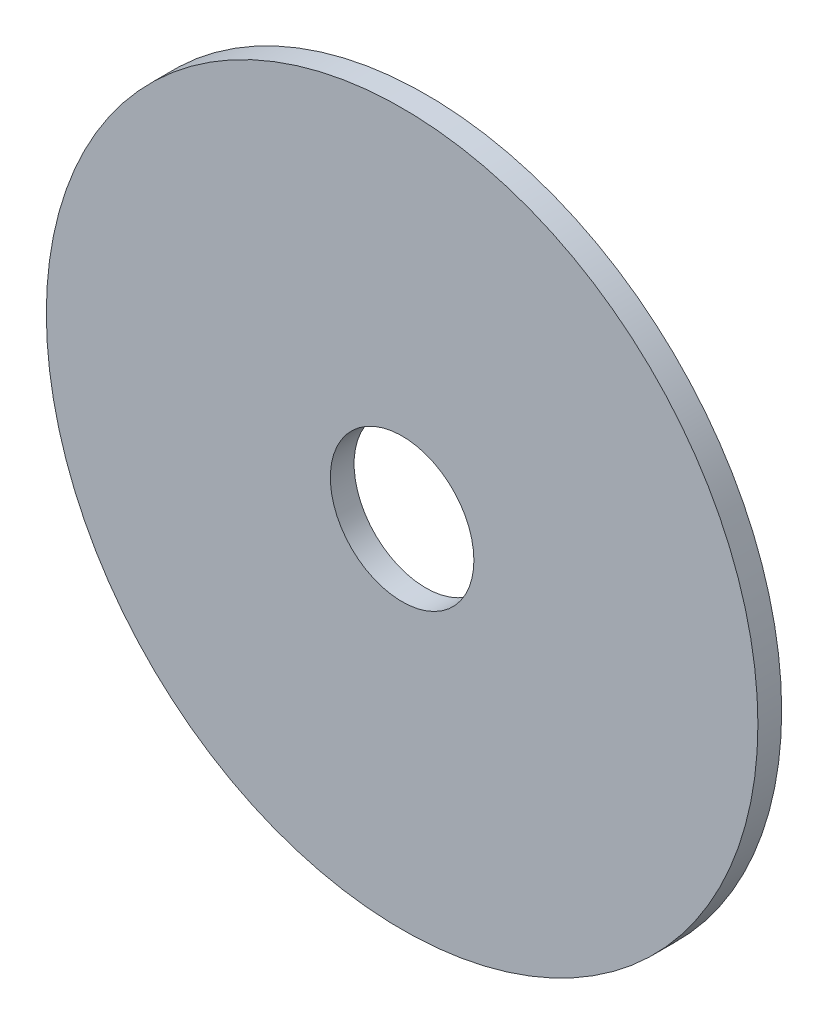
ISO-10303-21;
HEADER;
FILE_DESCRIPTION(('STEP AP214'),'2;1');
FILE_NAME('part.step','',(''),(''),'','','');
FILE_SCHEMA(('AUTOMOTIVE_DESIGN { 1 0 10303 214 1 1 1 1 }'));
ENDSEC;
DATA;
#1=APPLICATION_CONTEXT('core data for automotive mechanical design processes');
#2=APPLICATION_PROTOCOL_DEFINITION('international standard','automotive_design',2000,#1);
#3=PRODUCT_CONTEXT('',#1,'mechanical');
#4=PRODUCT('Part','Part','',(#3));
#5=PRODUCT_RELATED_PRODUCT_CATEGORY('part','',(#4));
#6=PRODUCT_DEFINITION_FORMATION('','',#4);
#7=PRODUCT_DEFINITION_CONTEXT('part definition',#1,'design');
#8=PRODUCT_DEFINITION('design','',#6,#7);
#9=PRODUCT_DEFINITION_SHAPE('','',#8);
#10=(LENGTH_UNIT() NAMED_UNIT(*) SI_UNIT(.MILLI.,.METRE.));
#11=(NAMED_UNIT(*) PLANE_ANGLE_UNIT() SI_UNIT($,.RADIAN.));
#12=(NAMED_UNIT(*) SI_UNIT($,.STERADIAN.) SOLID_ANGLE_UNIT());
#13=UNCERTAINTY_MEASURE_WITH_UNIT(LENGTH_MEASURE(1.E-05),#10,'distance_accuracy_value','');
#14=(GEOMETRIC_REPRESENTATION_CONTEXT(3) GLOBAL_UNCERTAINTY_ASSIGNED_CONTEXT((#13)) GLOBAL_UNIT_ASSIGNED_CONTEXT((#10,
#11,#12)) REPRESENTATION_CONTEXT('',''));
#15=CARTESIAN_POINT('',(0.,0.,0.));
#16=DIRECTION('',(0.,0.,1.));
#17=DIRECTION('',(1.,0.,0.));
#18=AXIS2_PLACEMENT_3D('',#15,#16,#17);
#19=CARTESIAN_POINT('',(0.,0.,-5.));
#20=DIRECTION('',(0.,0.,1.));
#21=DIRECTION('',(1.,0.,0.));
#22=AXIS2_PLACEMENT_3D('',#19,#20,#21);
#23=CYLINDRICAL_SURFACE('',#22,74.85);
#24=CARTESIAN_POINT('',(0.,0.,-5.));
#25=DIRECTION('',(0.,0.,1.));
#26=DIRECTION('',(1.,0.,0.));
#27=AXIS2_PLACEMENT_3D('',#24,#25,#26);
#28=CIRCLE('',#27,74.85);
#29=CARTESIAN_POINT('',(74.8500000000003,0.,-5.));
#30=VERTEX_POINT('',#29);
#31=EDGE_CURVE('E10',#30,#30,#28,.T.);
#32=ORIENTED_EDGE('',*,*,#31,.T.);
#33=EDGE_LOOP('',(#32));
#34=FACE_BOUND('',#33,.T.);
#35=CARTESIAN_POINT('',(0.,0.,0.));
#36=DIRECTION('',(0.,0.,1.));
#37=DIRECTION('',(1.,0.,0.));
#38=AXIS2_PLACEMENT_3D('',#35,#36,#37);
#39=CIRCLE('',#38,74.85);
#40=CARTESIAN_POINT('',(74.8500000000003,0.,0.));
#41=VERTEX_POINT('',#40);
#42=EDGE_CURVE('E33',#41,#41,#39,.T.);
#43=ORIENTED_EDGE('',*,*,#42,.F.);
#44=EDGE_LOOP('',(#43));
#45=FACE_BOUND('',#44,.T.);
#46=ADVANCED_FACE('F30',(#34,#45),#23,.T.);
#47=CARTESIAN_POINT('',(0.,0.,-5.));
#48=DIRECTION('',(0.,0.,1.));
#49=DIRECTION('',(1.,0.,0.));
#50=AXIS2_PLACEMENT_3D('',#47,#48,#49);
#51=PLANE('',#50);
#52=CARTESIAN_POINT('',(0.,0.,-5.));
#53=DIRECTION('',(0.,0.,1.));
#54=DIRECTION('',(1.,0.,0.));
#55=AXIS2_PLACEMENT_3D('',#52,#53,#54);
#56=CIRCLE('',#55,15.1);
#57=CARTESIAN_POINT('',(15.1000000000001,0.,-5.));
#58=VERTEX_POINT('',#57);
#59=EDGE_CURVE('E40',#58,#58,#56,.T.);
#60=ORIENTED_EDGE('',*,*,#59,.T.);
#61=EDGE_LOOP('',(#60));
#62=FACE_BOUND('',#61,.T.);
#63=ORIENTED_EDGE('',*,*,#31,.F.);
#64=EDGE_LOOP('',(#63));
#65=FACE_BOUND('',#64,.T.);
#66=ADVANCED_FACE('F48',(#62,#65),#51,.F.);
#67=CARTESIAN_POINT('',(0.,0.,0.));
#68=DIRECTION('',(0.,0.,1.));
#69=DIRECTION('',(1.,0.,0.));
#70=AXIS2_PLACEMENT_3D('',#67,#68,#69);
#71=PLANE('',#70);
#72=CARTESIAN_POINT('',(0.,0.,0.));
#73=DIRECTION('',(0.,0.,1.));
#74=DIRECTION('',(1.,0.,0.));
#75=AXIS2_PLACEMENT_3D('',#72,#73,#74);
#76=CIRCLE('',#75,15.1);
#77=CARTESIAN_POINT('',(15.1000000000001,0.,0.));
#78=VERTEX_POINT('',#77);
#79=EDGE_CURVE('E42',#78,#78,#76,.T.);
#80=ORIENTED_EDGE('',*,*,#79,.F.);
#81=EDGE_LOOP('',(#80));
#82=FACE_BOUND('',#81,.T.);
#83=ORIENTED_EDGE('',*,*,#42,.T.);
#84=EDGE_LOOP('',(#83));
#85=FACE_BOUND('',#84,.T.);
#86=ADVANCED_FACE('F54',(#82,#85),#71,.T.);
#87=CARTESIAN_POINT('',(0.,0.,-5.));
#88=DIRECTION('',(0.,0.,1.));
#89=DIRECTION('',(1.,0.,0.));
#90=AXIS2_PLACEMENT_3D('',#87,#88,#89);
#91=CYLINDRICAL_SURFACE('',#90,15.1);
#92=ORIENTED_EDGE('',*,*,#59,.F.);
#93=EDGE_LOOP('',(#92));
#94=FACE_BOUND('',#93,.T.);
#95=ORIENTED_EDGE('',*,*,#79,.T.);
#96=EDGE_LOOP('',(#95));
#97=FACE_BOUND('',#96,.T.);
#98=ADVANCED_FACE('F51',(#94,#97),#91,.F.);
#99=CLOSED_SHELL('',(#46,#66,#86,#98));
#100=MANIFOLD_SOLID_BREP('B2',#99);
#101=ADVANCED_BREP_SHAPE_REPRESENTATION('',(#18,#100),#14);
#102=SHAPE_DEFINITION_REPRESENTATION(#9,#101);
ENDSEC;
END-ISO-10303-21;
